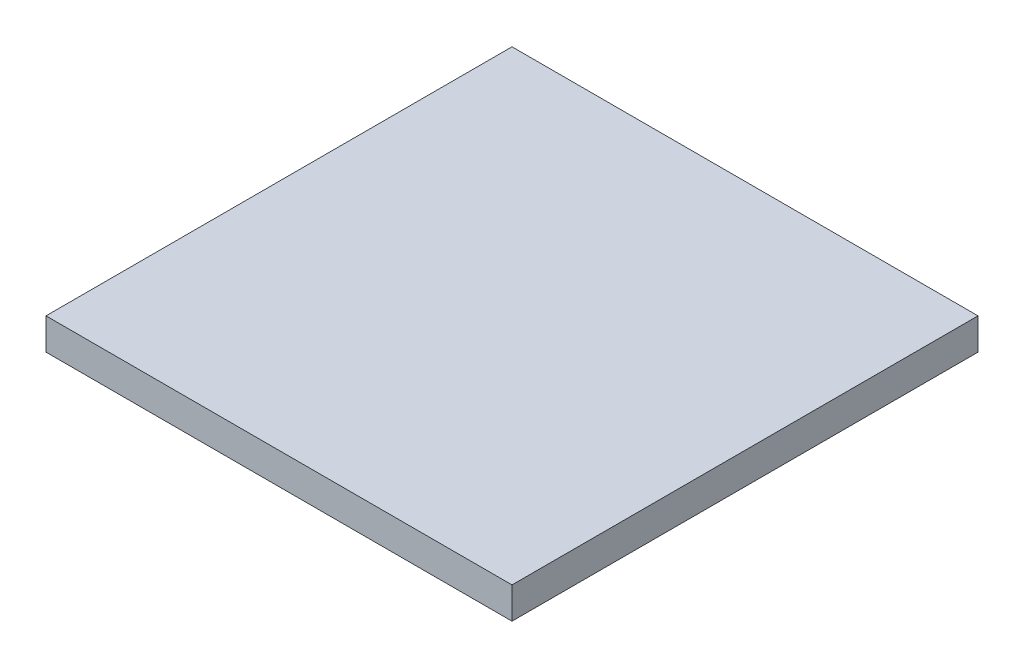
ISO-10303-21;
HEADER;
FILE_DESCRIPTION(('STEP AP214'),'2;1');
FILE_NAME('part.step','',(''),(''),'','','');
FILE_SCHEMA(('AUTOMOTIVE_DESIGN { 1 0 10303 214 1 1 1 1 }'));
ENDSEC;
DATA;
#1=APPLICATION_CONTEXT('core data for automotive mechanical design processes');
#2=APPLICATION_PROTOCOL_DEFINITION('international standard','automotive_design',2000,#1);
#3=PRODUCT_CONTEXT('',#1,'mechanical');
#4=PRODUCT('Part','Part','',(#3));
#5=PRODUCT_RELATED_PRODUCT_CATEGORY('part','',(#4));
#6=PRODUCT_DEFINITION_FORMATION('','',#4);
#7=PRODUCT_DEFINITION_CONTEXT('part definition',#1,'design');
#8=PRODUCT_DEFINITION('design','',#6,#7);
#9=PRODUCT_DEFINITION_SHAPE('','',#8);
#10=(LENGTH_UNIT() NAMED_UNIT(*) SI_UNIT(.MILLI.,.METRE.));
#11=(NAMED_UNIT(*) PLANE_ANGLE_UNIT() SI_UNIT($,.RADIAN.));
#12=(NAMED_UNIT(*) SI_UNIT($,.STERADIAN.) SOLID_ANGLE_UNIT());
#13=UNCERTAINTY_MEASURE_WITH_UNIT(LENGTH_MEASURE(1.E-05),#10,'distance_accuracy_value','');
#14=(GEOMETRIC_REPRESENTATION_CONTEXT(3) GLOBAL_UNCERTAINTY_ASSIGNED_CONTEXT((#13)) GLOBAL_UNIT_ASSIGNED_CONTEXT((#10,
#11,#12)) REPRESENTATION_CONTEXT('',''));
#15=CARTESIAN_POINT('',(0.,0.,0.));
#16=DIRECTION('',(0.,0.,1.));
#17=DIRECTION('',(1.,0.,0.));
#18=AXIS2_PLACEMENT_3D('',#15,#16,#17);
#19=CARTESIAN_POINT('',(20.4,0.675,-27.225));
#20=DIRECTION('',(1.,0.,0.));
#21=DIRECTION('',(0.,0.,-1.));
#22=AXIS2_PLACEMENT_3D('',#19,#20,#21);
#23=PLANE('',#22);
#24=DIRECTION('',(0.,0.,1.));
#25=VECTOR('',#24,1.);
#26=CARTESIAN_POINT('',(20.4,0.,-27.225));
#27=LINE('',#26,#25);
#28=CARTESIAN_POINT('',(20.4,0.,-27.225));
#29=VERTEX_POINT('',#28);
#30=CARTESIAN_POINT('',(20.4,0.,-17.225));
#31=VERTEX_POINT('',#30);
#32=EDGE_CURVE('E97',#29,#31,#27,.T.);
#33=ORIENTED_EDGE('',*,*,#32,.T.);
#34=DIRECTION('',(0.,-1.,0.));
#35=VECTOR('',#34,1.);
#36=CARTESIAN_POINT('',(20.4,0.675,-17.225));
#37=LINE('',#36,#35);
#38=CARTESIAN_POINT('',(20.4,0.675,-17.225));
#39=VERTEX_POINT('',#38);
#40=EDGE_CURVE('E11',#39,#31,#37,.T.);
#41=ORIENTED_EDGE('',*,*,#40,.F.);
#42=DIRECTION('',(0.,0.,1.));
#43=VECTOR('',#42,1.);
#44=CARTESIAN_POINT('',(20.4,0.675,-27.225));
#45=LINE('',#44,#43);
#46=CARTESIAN_POINT('',(20.4,0.675,-27.225));
#47=VERTEX_POINT('',#46);
#48=EDGE_CURVE('E85',#47,#39,#45,.T.);
#49=ORIENTED_EDGE('',*,*,#48,.F.);
#50=DIRECTION('',(0.,-1.,0.));
#51=VECTOR('',#50,1.);
#52=CARTESIAN_POINT('',(20.4,0.675,-27.225));
#53=LINE('',#52,#51);
#54=EDGE_CURVE('E93',#47,#29,#53,.T.);
#55=ORIENTED_EDGE('',*,*,#54,.T.);
#56=EDGE_LOOP('',(#33,#41,#49,#55));
#57=FACE_BOUND('',#56,.T.);
#58=ADVANCED_FACE('F34',(#57),#23,.F.);
#59=CARTESIAN_POINT('',(20.4,0.675,-17.225));
#60=DIRECTION('',(0.,0.,-1.));
#61=DIRECTION('',(-1.,0.,0.));
#62=AXIS2_PLACEMENT_3D('',#59,#60,#61);
#63=PLANE('',#62);
#64=DIRECTION('',(1.,0.,0.));
#65=VECTOR('',#64,1.);
#66=CARTESIAN_POINT('',(20.4,0.,-17.225));
#67=LINE('',#66,#65);
#68=CARTESIAN_POINT('',(30.4,0.,-17.225));
#69=VERTEX_POINT('',#68);
#70=EDGE_CURVE('E89',#31,#69,#67,.T.);
#71=ORIENTED_EDGE('',*,*,#70,.T.);
#72=DIRECTION('',(0.,-1.,0.));
#73=VECTOR('',#72,1.);
#74=CARTESIAN_POINT('',(30.4,0.675,-17.225));
#75=LINE('',#74,#73);
#76=CARTESIAN_POINT('',(30.4,0.675,-17.225));
#77=VERTEX_POINT('',#76);
#78=EDGE_CURVE('E42',#77,#69,#75,.T.);
#79=ORIENTED_EDGE('',*,*,#78,.F.);
#80=DIRECTION('',(1.,0.,0.));
#81=VECTOR('',#80,1.);
#82=CARTESIAN_POINT('',(20.4,0.675,-17.225));
#83=LINE('',#82,#81);
#84=EDGE_CURVE('E80',#39,#77,#83,.T.);
#85=ORIENTED_EDGE('',*,*,#84,.F.);
#86=ORIENTED_EDGE('',*,*,#40,.T.);
#87=EDGE_LOOP('',(#71,#79,#85,#86));
#88=FACE_BOUND('',#87,.T.);
#89=ADVANCED_FACE('F88',(#88),#63,.F.);
#90=CARTESIAN_POINT('',(30.4,0.675,-27.225));
#91=DIRECTION('',(-1.,0.,0.));
#92=DIRECTION('',(0.,0.,1.));
#93=AXIS2_PLACEMENT_3D('',#90,#91,#92);
#94=PLANE('',#93);
#95=DIRECTION('',(0.,0.,-1.));
#96=VECTOR('',#95,1.);
#97=CARTESIAN_POINT('',(30.4,0.,-27.225));
#98=LINE('',#97,#96);
#99=CARTESIAN_POINT('',(30.4,0.,-27.225));
#100=VERTEX_POINT('',#99);
#101=EDGE_CURVE('E67',#69,#100,#98,.T.);
#102=ORIENTED_EDGE('',*,*,#101,.T.);
#103=DIRECTION('',(0.,-1.,0.));
#104=VECTOR('',#103,1.);
#105=CARTESIAN_POINT('',(30.4,0.675,-27.225));
#106=LINE('',#105,#104);
#107=CARTESIAN_POINT('',(30.4,0.675,-27.225));
#108=VERTEX_POINT('',#107);
#109=EDGE_CURVE('E90',#108,#100,#106,.T.);
#110=ORIENTED_EDGE('',*,*,#109,.F.);
#111=DIRECTION('',(0.,0.,-1.));
#112=VECTOR('',#111,1.);
#113=CARTESIAN_POINT('',(30.4,0.675,-27.225));
#114=LINE('',#113,#112);
#115=EDGE_CURVE('E83',#77,#108,#114,.T.);
#116=ORIENTED_EDGE('',*,*,#115,.F.);
#117=ORIENTED_EDGE('',*,*,#78,.T.);
#118=EDGE_LOOP('',(#102,#110,#116,#117));
#119=FACE_BOUND('',#118,.T.);
#120=ADVANCED_FACE('F91',(#119),#94,.F.);
#121=CARTESIAN_POINT('',(20.4,0.675,-27.225));
#122=DIRECTION('',(0.,0.,1.));
#123=DIRECTION('',(1.,0.,0.));
#124=AXIS2_PLACEMENT_3D('',#121,#122,#123);
#125=PLANE('',#124);
#126=DIRECTION('',(-1.,0.,0.));
#127=VECTOR('',#126,1.);
#128=CARTESIAN_POINT('',(20.4,0.,-27.225));
#129=LINE('',#128,#127);
#130=EDGE_CURVE('E73',#100,#29,#129,.T.);
#131=ORIENTED_EDGE('',*,*,#130,.T.);
#132=ORIENTED_EDGE('',*,*,#54,.F.);
#133=DIRECTION('',(-1.,0.,0.));
#134=VECTOR('',#133,1.);
#135=CARTESIAN_POINT('',(20.4,0.675,-27.225));
#136=LINE('',#135,#134);
#137=EDGE_CURVE('E50',#108,#47,#136,.T.);
#138=ORIENTED_EDGE('',*,*,#137,.F.);
#139=ORIENTED_EDGE('',*,*,#109,.T.);
#140=EDGE_LOOP('',(#131,#132,#138,#139));
#141=FACE_BOUND('',#140,.T.);
#142=ADVANCED_FACE('F104',(#141),#125,.F.);
#143=CARTESIAN_POINT('',(0.,0.675,0.));
#144=DIRECTION('',(0.,1.,0.));
#145=DIRECTION('',(0.,0.,1.));
#146=AXIS2_PLACEMENT_3D('',#143,#144,#145);
#147=PLANE('',#146);
#148=ORIENTED_EDGE('',*,*,#48,.T.);
#149=ORIENTED_EDGE('',*,*,#84,.T.);
#150=ORIENTED_EDGE('',*,*,#115,.T.);
#151=ORIENTED_EDGE('',*,*,#137,.T.);
#152=EDGE_LOOP('',(#148,#149,#150,#151));
#153=FACE_BOUND('',#152,.T.);
#154=ADVANCED_FACE('F81',(#153),#147,.T.);
#155=CARTESIAN_POINT('',(0.,0.,0.));
#156=DIRECTION('',(0.,1.,0.));
#157=DIRECTION('',(0.,0.,1.));
#158=AXIS2_PLACEMENT_3D('',#155,#156,#157);
#159=PLANE('',#158);
#160=ORIENTED_EDGE('',*,*,#32,.F.);
#161=ORIENTED_EDGE('',*,*,#130,.F.);
#162=ORIENTED_EDGE('',*,*,#101,.F.);
#163=ORIENTED_EDGE('',*,*,#70,.F.);
#164=EDGE_LOOP('',(#160,#161,#162,#163));
#165=FACE_BOUND('',#164,.T.);
#166=ADVANCED_FACE('F107',(#165),#159,.F.);
#167=CLOSED_SHELL('',(#58,#89,#120,#142,#154,#166));
#168=MANIFOLD_SOLID_BREP('B2',#167);
#169=ADVANCED_BREP_SHAPE_REPRESENTATION('',(#18,#168),#14);
#170=SHAPE_DEFINITION_REPRESENTATION(#9,#169);
ENDSEC;
END-ISO-10303-21;
